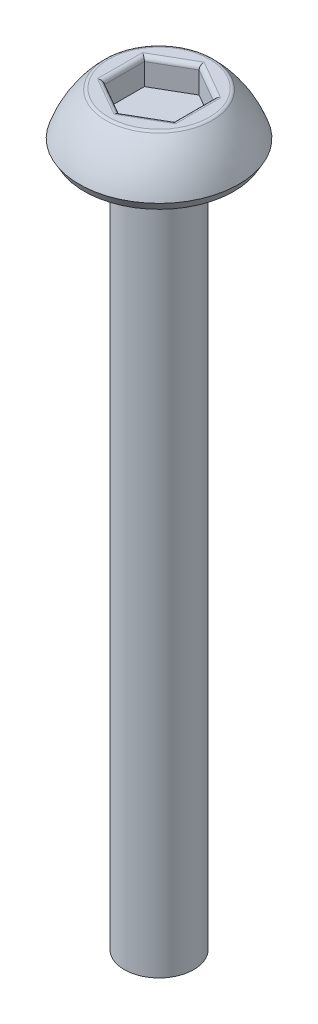
ISO-10303-21;
HEADER;
FILE_DESCRIPTION(('STEP AP214'),'2;1');
FILE_NAME('part.step','',(''),(''),'','','');
FILE_SCHEMA(('AUTOMOTIVE_DESIGN { 1 0 10303 214 1 1 1 1 }'));
ENDSEC;
DATA;
#1=APPLICATION_CONTEXT('core data for automotive mechanical design processes');
#2=APPLICATION_PROTOCOL_DEFINITION('international standard','automotive_design',2000,#1);
#3=PRODUCT_CONTEXT('',#1,'mechanical');
#4=PRODUCT('Part','Part','',(#3));
#5=PRODUCT_RELATED_PRODUCT_CATEGORY('part','',(#4));
#6=PRODUCT_DEFINITION_FORMATION('','',#4);
#7=PRODUCT_DEFINITION_CONTEXT('part definition',#1,'design');
#8=PRODUCT_DEFINITION('design','',#6,#7);
#9=PRODUCT_DEFINITION_SHAPE('','',#8);
#10=(LENGTH_UNIT() NAMED_UNIT(*) SI_UNIT(.MILLI.,.METRE.));
#11=(NAMED_UNIT(*) PLANE_ANGLE_UNIT() SI_UNIT($,.RADIAN.));
#12=(NAMED_UNIT(*) SI_UNIT($,.STERADIAN.) SOLID_ANGLE_UNIT());
#13=UNCERTAINTY_MEASURE_WITH_UNIT(LENGTH_MEASURE(1.E-05),#10,'distance_accuracy_value','');
#14=(GEOMETRIC_REPRESENTATION_CONTEXT(3) GLOBAL_UNCERTAINTY_ASSIGNED_CONTEXT((#13)) GLOBAL_UNIT_ASSIGNED_CONTEXT((#10,
#11,#12)) REPRESENTATION_CONTEXT('',''));
#15=CARTESIAN_POINT('',(0.,0.,0.));
#16=DIRECTION('',(0.,0.,1.));
#17=DIRECTION('',(1.,0.,0.));
#18=AXIS2_PLACEMENT_3D('',#15,#16,#17);
#19=CARTESIAN_POINT('',(0.,1.5,0.));
#20=DIRECTION('',(0.,-1.,0.));
#21=DIRECTION('',(0.,0.,-1.));
#22=AXIS2_PLACEMENT_3D('',#19,#20,#21);
#23=PLANE('',#22);
#24=CARTESIAN_POINT('',(0.,1.5,0.));
#25=DIRECTION('',(0.,-1.,0.));
#26=DIRECTION('',(0.,0.,-1.));
#27=AXIS2_PLACEMENT_3D('',#24,#25,#26);
#28=CIRCLE('',#27,1.45007695941143);
#29=CARTESIAN_POINT('',(0.,1.5,-1.45007695941143));
#30=VERTEX_POINT('',#29);
#31=EDGE_CURVE('E178',#30,#30,#28,.F.);
#32=ORIENTED_EDGE('',*,*,#31,.T.);
#33=EDGE_LOOP('',(#32));
#34=FACE_BOUND('',#33,.T.);
#35=DIRECTION('',(0.866025403784439,0.,-0.5));
#36=VECTOR('',#35,1.);
#37=CARTESIAN_POINT('',(0.5625,1.5,0.974278579257493));
#38=LINE('',#37,#36);
#39=CARTESIAN_POINT('',(1.125,1.5,0.649519052838329));
#40=VERTEX_POINT('',#39);
#41=CARTESIAN_POINT('',(0.,1.5,1.29903810567666));
#42=VERTEX_POINT('',#41);
#43=EDGE_CURVE('E173',#40,#42,#38,.F.);
#44=ORIENTED_EDGE('',*,*,#43,.T.);
#45=DIRECTION('',(0.866025403784439,0.,0.5));
#46=VECTOR('',#45,1.);
#47=CARTESIAN_POINT('',(-0.5625,1.5,0.974278579257493));
#48=LINE('',#47,#46);
#49=CARTESIAN_POINT('',(-1.125,1.5,0.649519052838329));
#50=VERTEX_POINT('',#49);
#51=EDGE_CURVE('E175',#42,#50,#48,.F.);
#52=ORIENTED_EDGE('',*,*,#51,.T.);
#53=DIRECTION('',(0.,0.,1.));
#54=VECTOR('',#53,1.);
#55=CARTESIAN_POINT('',(-1.125,1.5,0.));
#56=LINE('',#55,#54);
#57=CARTESIAN_POINT('',(-1.125,1.5,-0.649519052838329));
#58=VERTEX_POINT('',#57);
#59=EDGE_CURVE('E165',#50,#58,#56,.F.);
#60=ORIENTED_EDGE('',*,*,#59,.T.);
#61=DIRECTION('',(-0.866025403784439,0.,0.5));
#62=VECTOR('',#61,1.);
#63=CARTESIAN_POINT('',(-0.5625,1.5,-0.974278579257493));
#64=LINE('',#63,#62);
#65=CARTESIAN_POINT('',(0.,1.5,-1.29903810567666));
#66=VERTEX_POINT('',#65);
#67=EDGE_CURVE('E167',#58,#66,#64,.F.);
#68=ORIENTED_EDGE('',*,*,#67,.T.);
#69=DIRECTION('',(-0.866025403784439,0.,-0.5));
#70=VECTOR('',#69,1.);
#71=CARTESIAN_POINT('',(0.5625,1.5,-0.974278579257494));
#72=LINE('',#71,#70);
#73=CARTESIAN_POINT('',(1.125,1.5,-0.64951905283833));
#74=VERTEX_POINT('',#73);
#75=EDGE_CURVE('E169',#66,#74,#72,.F.);
#76=ORIENTED_EDGE('',*,*,#75,.T.);
#77=DIRECTION('',(0.,0.,-1.));
#78=VECTOR('',#77,1.);
#79=CARTESIAN_POINT('',(1.125,1.5,0.));
#80=LINE('',#79,#78);
#81=EDGE_CURVE('E171',#74,#40,#80,.F.);
#82=ORIENTED_EDGE('',*,*,#81,.T.);
#83=EDGE_LOOP('',(#44,#52,#60,#68,#76,#82));
#84=FACE_BOUND('',#83,.T.);
#85=ADVANCED_FACE('F36',(#34,#84),#23,.F.);
#86=CARTESIAN_POINT('',(0.,-0.691910970237067,0.));
#87=DIRECTION('',(0.,-1.,0.));
#88=DIRECTION('',(0.,0.,-1.));
#89=AXIS2_PLACEMENT_3D('',#86,#87,#88);
#90=DEGENERATE_TOROIDAL_SURFACE('',#89,0.548298390995416,3.,.F.);
#91=CARTESIAN_POINT('',(0.,1.46486569435813,0.));
#92=DIRECTION('',(0.,-1.,0.));
#93=DIRECTION('',(0.,0.,-1.));
#94=AXIS2_PLACEMENT_3D('',#91,#92,#93);
#95=CIRCLE('',#94,1.53696284421173);
#96=CARTESIAN_POINT('',(0.,1.46486569435813,-1.53696284421173));
#97=VERTEX_POINT('',#96);
#98=EDGE_CURVE('E162',#97,#97,#95,.T.);
#99=ORIENTED_EDGE('',*,*,#98,.T.);
#100=EDGE_LOOP('',(#99));
#101=FACE_BOUND('',#100,.T.);
#102=CARTESIAN_POINT('',(0.,0.25,0.));
#103=DIRECTION('',(0.,-1.,0.));
#104=DIRECTION('',(0.,0.,-1.));
#105=AXIS2_PLACEMENT_3D('',#102,#103,#104);
#106=CIRCLE('',#105,2.3);
#107=CARTESIAN_POINT('',(0.,0.25,-2.3));
#108=VERTEX_POINT('',#107);
#109=EDGE_CURVE('E159',#108,#108,#106,.T.);
#110=ORIENTED_EDGE('',*,*,#109,.F.);
#111=EDGE_LOOP('',(#110));
#112=FACE_BOUND('',#111,.T.);
#113=ADVANCED_FACE('F245',(#101,#112),#90,.F.);
#114=CARTESIAN_POINT('',(0.,0.25,0.));
#115=DIRECTION('',(0.,1.,0.));
#116=DIRECTION('',(0.,0.,1.));
#117=AXIS2_PLACEMENT_3D('',#114,#115,#116);
#118=CONICAL_SURFACE('',#117,2.3,0.523598775598296);
#119=CARTESIAN_POINT('',(0.,0.,0.));
#120=DIRECTION('',(0.,-1.,0.));
#121=DIRECTION('',(0.,0.,-1.));
#122=AXIS2_PLACEMENT_3D('',#119,#120,#121);
#123=CIRCLE('',#122,2.15566243270259);
#124=CARTESIAN_POINT('',(0.,0.,-2.15566243270259));
#125=VERTEX_POINT('',#124);
#126=EDGE_CURVE('E156',#125,#125,#123,.T.);
#127=ORIENTED_EDGE('',*,*,#126,.F.);
#128=EDGE_LOOP('',(#127));
#129=FACE_BOUND('',#128,.T.);
#130=ORIENTED_EDGE('',*,*,#109,.T.);
#131=EDGE_LOOP('',(#130));
#132=FACE_BOUND('',#131,.T.);
#133=ADVANCED_FACE('F251',(#129,#132),#118,.T.);
#134=CARTESIAN_POINT('',(0.,0.,2.15566243270259));
#135=DIRECTION('',(0.,1.,0.));
#136=DIRECTION('',(0.,0.,1.));
#137=AXIS2_PLACEMENT_3D('',#134,#135,#136);
#138=PLANE('',#137);
#139=CARTESIAN_POINT('',(0.,0.,0.));
#140=DIRECTION('',(0.,-1.,0.));
#141=DIRECTION('',(0.,0.,-1.));
#142=AXIS2_PLACEMENT_3D('',#139,#140,#141);
#143=CIRCLE('',#142,1.);
#144=CARTESIAN_POINT('',(0.,0.,-1.));
#145=VERTEX_POINT('',#144);
#146=EDGE_CURVE('E153',#145,#145,#143,.T.);
#147=ORIENTED_EDGE('',*,*,#146,.F.);
#148=EDGE_LOOP('',(#147));
#149=FACE_BOUND('',#148,.T.);
#150=ORIENTED_EDGE('',*,*,#126,.T.);
#151=EDGE_LOOP('',(#150));
#152=FACE_BOUND('',#151,.T.);
#153=ADVANCED_FACE('F270',(#149,#152),#138,.F.);
#154=CARTESIAN_POINT('',(0.,-20.,0.));
#155=DIRECTION('',(0.,-1.,0.));
#156=DIRECTION('',(0.,0.,-1.));
#157=AXIS2_PLACEMENT_3D('',#154,#155,#156);
#158=CYLINDRICAL_SURFACE('',#157,0.999999999999999);
#159=CARTESIAN_POINT('',(0.,-20.,0.));
#160=DIRECTION('',(0.,-1.,0.));
#161=DIRECTION('',(0.,0.,-1.));
#162=AXIS2_PLACEMENT_3D('',#159,#160,#161);
#163=CIRCLE('',#162,0.999999999999998);
#164=CARTESIAN_POINT('',(0.,-20.,-0.999999999999998));
#165=VERTEX_POINT('',#164);
#166=EDGE_CURVE('E140',#165,#165,#163,.T.);
#167=ORIENTED_EDGE('',*,*,#166,.F.);
#168=EDGE_LOOP('',(#167));
#169=FACE_BOUND('',#168,.T.);
#170=ORIENTED_EDGE('',*,*,#146,.T.);
#171=EDGE_LOOP('',(#170));
#172=FACE_BOUND('',#171,.T.);
#173=ADVANCED_FACE('F275',(#169,#172),#158,.T.);
#174=CARTESIAN_POINT('',(0.,-20.,0.999999999999998));
#175=DIRECTION('',(0.,1.,0.));
#176=DIRECTION('',(0.,0.,1.));
#177=AXIS2_PLACEMENT_3D('',#174,#175,#176);
#178=PLANE('',#177);
#179=ORIENTED_EDGE('',*,*,#166,.T.);
#180=EDGE_LOOP('',(#179));
#181=FACE_BOUND('',#180,.T.);
#182=ADVANCED_FACE('F282',(#181),#178,.F.);
#183=CARTESIAN_POINT('',(0.999999999999999,0.75,-0.577350269189626));
#184=DIRECTION('',(0.5,0.,-0.866025403784439));
#185=DIRECTION('',(-0.866025403784439,0.,-0.5));
#186=AXIS2_PLACEMENT_3D('',#183,#184,#185);
#187=PLANE('',#186);
#188=DIRECTION('',(0.,1.,0.));
#189=VECTOR('',#188,1.);
#190=CARTESIAN_POINT('',(0.999999999999999,0.75,-0.577350269189626));
#191=LINE('',#190,#189);
#192=CARTESIAN_POINT('',(0.999999999999999,0.75,-0.577350269189626));
#193=VERTEX_POINT('',#192);
#194=CARTESIAN_POINT('',(0.999999999999999,1.375,-0.577350269189626));
#195=VERTEX_POINT('',#194);
#196=EDGE_CURVE('E138',#193,#195,#191,.T.);
#197=ORIENTED_EDGE('',*,*,#196,.T.);
#198=DIRECTION('',(-0.866025403784439,0.,-0.5));
#199=VECTOR('',#198,1.);
#200=CARTESIAN_POINT('',(0.999999999999999,1.375,-0.577350269189626));
#201=LINE('',#200,#199);
#202=CARTESIAN_POINT('',(0.,1.375,-1.15470053837925));
#203=VERTEX_POINT('',#202);
#204=EDGE_CURVE('E60',#195,#203,#201,.T.);
#205=ORIENTED_EDGE('',*,*,#204,.T.);
#206=DIRECTION('',(0.,1.,0.));
#207=VECTOR('',#206,1.);
#208=CARTESIAN_POINT('',(0.,0.75,-1.15470053837925));
#209=LINE('',#208,#207);
#210=CARTESIAN_POINT('',(0.,0.75,-1.15470053837925));
#211=VERTEX_POINT('',#210);
#212=EDGE_CURVE('E106',#211,#203,#209,.T.);
#213=ORIENTED_EDGE('',*,*,#212,.F.);
#214=DIRECTION('',(-0.866025403784439,0.,-0.5));
#215=VECTOR('',#214,1.);
#216=CARTESIAN_POINT('',(0.999999999999999,0.75,-0.577350269189626));
#217=LINE('',#216,#215);
#218=EDGE_CURVE('E110',#193,#211,#217,.T.);
#219=ORIENTED_EDGE('',*,*,#218,.F.);
#220=EDGE_LOOP('',(#197,#205,#213,#219));
#221=FACE_BOUND('',#220,.T.);
#222=ADVANCED_FACE('F108',(#221),#187,.F.);
#223=CARTESIAN_POINT('',(1.,0.75,0.577350269189626));
#224=DIRECTION('',(1.,0.,0.));
#225=DIRECTION('',(0.,0.,-1.));
#226=AXIS2_PLACEMENT_3D('',#223,#224,#225);
#227=PLANE('',#226);
#228=DIRECTION('',(0.,1.,0.));
#229=VECTOR('',#228,1.);
#230=CARTESIAN_POINT('',(1.,0.75,0.577350269189626));
#231=LINE('',#230,#229);
#232=CARTESIAN_POINT('',(1.,0.75,0.577350269189626));
#233=VERTEX_POINT('',#232);
#234=CARTESIAN_POINT('',(1.,1.375,0.577350269189626));
#235=VERTEX_POINT('',#234);
#236=EDGE_CURVE('E141',#233,#235,#231,.T.);
#237=ORIENTED_EDGE('',*,*,#236,.T.);
#238=DIRECTION('',(0.,0.,-1.));
#239=VECTOR('',#238,1.);
#240=CARTESIAN_POINT('',(1.,1.375,0.577350269189626));
#241=LINE('',#240,#239);
#242=EDGE_CURVE('E186',#235,#195,#241,.T.);
#243=ORIENTED_EDGE('',*,*,#242,.T.);
#244=ORIENTED_EDGE('',*,*,#196,.F.);
#245=DIRECTION('',(0.,0.,-1.));
#246=VECTOR('',#245,1.);
#247=CARTESIAN_POINT('',(1.,0.75,0.577350269189626));
#248=LINE('',#247,#246);
#249=EDGE_CURVE('E114',#233,#193,#248,.T.);
#250=ORIENTED_EDGE('',*,*,#249,.F.);
#251=EDGE_LOOP('',(#237,#243,#244,#250));
#252=FACE_BOUND('',#251,.T.);
#253=ADVANCED_FACE('F226',(#252),#227,.F.);
#254=CARTESIAN_POINT('',(0.,0.75,1.15470053837925));
#255=DIRECTION('',(0.5,0.,0.866025403784439));
#256=DIRECTION('',(0.866025403784439,0.,-0.5));
#257=AXIS2_PLACEMENT_3D('',#254,#255,#256);
#258=PLANE('',#257);
#259=DIRECTION('',(0.,1.,0.));
#260=VECTOR('',#259,1.);
#261=CARTESIAN_POINT('',(0.,0.75,1.15470053837925));
#262=LINE('',#261,#260);
#263=CARTESIAN_POINT('',(0.,0.75,1.15470053837925));
#264=VERTEX_POINT('',#263);
#265=CARTESIAN_POINT('',(0.,1.375,1.15470053837925));
#266=VERTEX_POINT('',#265);
#267=EDGE_CURVE('E144',#264,#266,#262,.T.);
#268=ORIENTED_EDGE('',*,*,#267,.T.);
#269=DIRECTION('',(0.866025403784439,0.,-0.5));
#270=VECTOR('',#269,1.);
#271=CARTESIAN_POINT('',(0.,1.375,1.15470053837925));
#272=LINE('',#271,#270);
#273=EDGE_CURVE('E184',#266,#235,#272,.T.);
#274=ORIENTED_EDGE('',*,*,#273,.T.);
#275=ORIENTED_EDGE('',*,*,#236,.F.);
#276=DIRECTION('',(0.866025403784439,0.,-0.5));
#277=VECTOR('',#276,1.);
#278=CARTESIAN_POINT('',(0.,0.75,1.15470053837925));
#279=LINE('',#278,#277);
#280=EDGE_CURVE('E135',#264,#233,#279,.T.);
#281=ORIENTED_EDGE('',*,*,#280,.F.);
#282=EDGE_LOOP('',(#268,#274,#275,#281));
#283=FACE_BOUND('',#282,.T.);
#284=ADVANCED_FACE('F227',(#283),#258,.F.);
#285=CARTESIAN_POINT('',(-0.999999999999999,0.75,0.577350269189626));
#286=DIRECTION('',(-0.5,0.,0.866025403784439));
#287=DIRECTION('',(0.866025403784439,0.,0.5));
#288=AXIS2_PLACEMENT_3D('',#285,#286,#287);
#289=PLANE('',#288);
#290=DIRECTION('',(0.,1.,0.));
#291=VECTOR('',#290,1.);
#292=CARTESIAN_POINT('',(-0.999999999999999,0.75,0.577350269189626));
#293=LINE('',#292,#291);
#294=CARTESIAN_POINT('',(-0.999999999999999,0.75,0.577350269189626));
#295=VERTEX_POINT('',#294);
#296=CARTESIAN_POINT('',(-0.999999999999999,1.375,0.577350269189626));
#297=VERTEX_POINT('',#296);
#298=EDGE_CURVE('E147',#295,#297,#293,.T.);
#299=ORIENTED_EDGE('',*,*,#298,.T.);
#300=DIRECTION('',(0.866025403784439,0.,0.5));
#301=VECTOR('',#300,1.);
#302=CARTESIAN_POINT('',(-0.999999999999999,1.375,0.577350269189626));
#303=LINE('',#302,#301);
#304=EDGE_CURVE('E181',#297,#266,#303,.T.);
#305=ORIENTED_EDGE('',*,*,#304,.T.);
#306=ORIENTED_EDGE('',*,*,#267,.F.);
#307=DIRECTION('',(0.866025403784439,0.,0.5));
#308=VECTOR('',#307,1.);
#309=CARTESIAN_POINT('',(-0.999999999999999,0.75,0.577350269189626));
#310=LINE('',#309,#308);
#311=EDGE_CURVE('E132',#295,#264,#310,.T.);
#312=ORIENTED_EDGE('',*,*,#311,.F.);
#313=EDGE_LOOP('',(#299,#305,#306,#312));
#314=FACE_BOUND('',#313,.T.);
#315=ADVANCED_FACE('F222',(#314),#289,.F.);
#316=CARTESIAN_POINT('',(-1.,0.75,-0.577350269189626));
#317=DIRECTION('',(-1.,0.,0.));
#318=DIRECTION('',(0.,0.,1.));
#319=AXIS2_PLACEMENT_3D('',#316,#317,#318);
#320=PLANE('',#319);
#321=DIRECTION('',(0.,1.,0.));
#322=VECTOR('',#321,1.);
#323=CARTESIAN_POINT('',(-1.,0.75,-0.577350269189626));
#324=LINE('',#323,#322);
#325=CARTESIAN_POINT('',(-1.,0.75,-0.577350269189626));
#326=VERTEX_POINT('',#325);
#327=CARTESIAN_POINT('',(-1.,1.375,-0.577350269189626));
#328=VERTEX_POINT('',#327);
#329=EDGE_CURVE('E113',#326,#328,#324,.T.);
#330=ORIENTED_EDGE('',*,*,#329,.T.);
#331=DIRECTION('',(0.,0.,1.));
#332=VECTOR('',#331,1.);
#333=CARTESIAN_POINT('',(-1.,1.375,-0.577350269189626));
#334=LINE('',#333,#332);
#335=EDGE_CURVE('E11',#328,#297,#334,.T.);
#336=ORIENTED_EDGE('',*,*,#335,.T.);
#337=ORIENTED_EDGE('',*,*,#298,.F.);
#338=DIRECTION('',(0.,0.,1.));
#339=VECTOR('',#338,1.);
#340=CARTESIAN_POINT('',(-1.,0.75,-0.577350269189626));
#341=LINE('',#340,#339);
#342=EDGE_CURVE('E122',#326,#295,#341,.T.);
#343=ORIENTED_EDGE('',*,*,#342,.F.);
#344=EDGE_LOOP('',(#330,#336,#337,#343));
#345=FACE_BOUND('',#344,.T.);
#346=ADVANCED_FACE('F219',(#345),#320,.F.);
#347=CARTESIAN_POINT('',(0.,0.75,-1.15470053837925));
#348=DIRECTION('',(-0.5,0.,-0.866025403784438));
#349=DIRECTION('',(-0.866025403784439,0.,0.5));
#350=AXIS2_PLACEMENT_3D('',#347,#348,#349);
#351=PLANE('',#350);
#352=ORIENTED_EDGE('',*,*,#212,.T.);
#353=DIRECTION('',(-0.866025403784439,0.,0.5));
#354=VECTOR('',#353,1.);
#355=CARTESIAN_POINT('',(0.,1.375,-1.15470053837925));
#356=LINE('',#355,#354);
#357=EDGE_CURVE('E45',#203,#328,#356,.T.);
#358=ORIENTED_EDGE('',*,*,#357,.T.);
#359=ORIENTED_EDGE('',*,*,#329,.F.);
#360=DIRECTION('',(-0.866025403784439,0.,0.5));
#361=VECTOR('',#360,1.);
#362=CARTESIAN_POINT('',(0.,0.75,-1.15470053837925));
#363=LINE('',#362,#361);
#364=EDGE_CURVE('E117',#211,#326,#363,.T.);
#365=ORIENTED_EDGE('',*,*,#364,.F.);
#366=EDGE_LOOP('',(#352,#358,#359,#365));
#367=FACE_BOUND('',#366,.T.);
#368=ADVANCED_FACE('F118',(#367),#351,.F.);
#369=CARTESIAN_POINT('',(0.,0.75,0.));
#370=DIRECTION('',(0.,1.,0.));
#371=DIRECTION('',(0.,0.,1.));
#372=AXIS2_PLACEMENT_3D('',#369,#370,#371);
#373=PLANE('',#372);
#374=ORIENTED_EDGE('',*,*,#218,.T.);
#375=ORIENTED_EDGE('',*,*,#364,.T.);
#376=ORIENTED_EDGE('',*,*,#342,.T.);
#377=ORIENTED_EDGE('',*,*,#311,.T.);
#378=ORIENTED_EDGE('',*,*,#280,.T.);
#379=ORIENTED_EDGE('',*,*,#249,.T.);
#380=EDGE_LOOP('',(#374,#375,#376,#377,#378,#379));
#381=FACE_BOUND('',#380,.T.);
#382=ADVANCED_FACE('F124',(#381),#373,.T.);
#383=CARTESIAN_POINT('',(0.,1.375,0.));
#384=DIRECTION('',(0.,-1.,0.));
#385=DIRECTION('',(0.,0.,-1.));
#386=AXIS2_PLACEMENT_3D('',#383,#384,#385);
#387=TOROIDAL_SURFACE('',#386,1.45007695941143,0.125);
#388=ORIENTED_EDGE('',*,*,#31,.F.);
#389=EDGE_LOOP('',(#388));
#390=FACE_BOUND('',#389,.T.);
#391=ORIENTED_EDGE('',*,*,#98,.F.);
#392=EDGE_LOOP('',(#391));
#393=FACE_BOUND('',#392,.T.);
#394=ADVANCED_FACE('F255',(#390,#393),#387,.T.);
#395=CARTESIAN_POINT('',(1.0625,1.375,-0.685603444662681));
#396=DIRECTION('',(-0.866025403784439,0.,-0.5));
#397=DIRECTION('',(-0.5,0.,0.866025403784439));
#398=AXIS2_PLACEMENT_3D('',#395,#396,#397);
#399=CYLINDRICAL_SURFACE('',#398,0.125);
#400=CARTESIAN_POINT('',(1.125,1.375,-0.64951905283833));
#401=DIRECTION('',(-0.5,0.,-0.866025403784438));
#402=DIRECTION('',(0.866025403784439,0.,-0.5));
#403=AXIS2_PLACEMENT_3D('',#400,#401,#402);
#404=ELLIPSE('',#403,0.144337567297406,0.125);
#405=EDGE_CURVE('E129',#74,#195,#404,.F.);
#406=ORIENTED_EDGE('',*,*,#405,.F.);
#407=ORIENTED_EDGE('',*,*,#75,.F.);
#408=CARTESIAN_POINT('',(0.,1.375,-1.29903810567666));
#409=DIRECTION('',(-1.,0.,0.));
#410=DIRECTION('',(0.,0.,-1.));
#411=AXIS2_PLACEMENT_3D('',#408,#409,#410);
#412=ELLIPSE('',#411,0.144337567297406,0.125);
#413=EDGE_CURVE('E40',#203,#66,#412,.T.);
#414=ORIENTED_EDGE('',*,*,#413,.F.);
#415=ORIENTED_EDGE('',*,*,#204,.F.);
#416=EDGE_LOOP('',(#406,#407,#414,#415));
#417=FACE_BOUND('',#416,.T.);
#418=ADVANCED_FACE('F38',(#417),#399,.T.);
#419=CARTESIAN_POINT('',(-0.0625000000000002,1.375,-1.26295371385231));
#420=DIRECTION('',(-0.866025403784439,0.,0.5));
#421=DIRECTION('',(0.5,0.,0.866025403784439));
#422=AXIS2_PLACEMENT_3D('',#419,#420,#421);
#423=CYLINDRICAL_SURFACE('',#422,0.125);
#424=ORIENTED_EDGE('',*,*,#413,.T.);
#425=ORIENTED_EDGE('',*,*,#67,.F.);
#426=CARTESIAN_POINT('',(-1.125,1.375,-0.649519052838329));
#427=DIRECTION('',(-0.5,0.,0.866025403784439));
#428=DIRECTION('',(-0.866025403784439,0.,-0.5));
#429=AXIS2_PLACEMENT_3D('',#426,#427,#428);
#430=ELLIPSE('',#429,0.144337567297406,0.125);
#431=EDGE_CURVE('E197',#328,#58,#430,.T.);
#432=ORIENTED_EDGE('',*,*,#431,.F.);
#433=ORIENTED_EDGE('',*,*,#357,.F.);
#434=EDGE_LOOP('',(#424,#425,#432,#433));
#435=FACE_BOUND('',#434,.T.);
#436=ADVANCED_FACE('F211',(#435),#423,.T.);
#437=CARTESIAN_POINT('',(1.125,1.375,0.577350269189626));
#438=DIRECTION('',(0.,0.,-1.));
#439=DIRECTION('',(-1.,0.,0.));
#440=AXIS2_PLACEMENT_3D('',#437,#438,#439);
#441=CYLINDRICAL_SURFACE('',#440,0.125);
#442=ORIENTED_EDGE('',*,*,#405,.T.);
#443=ORIENTED_EDGE('',*,*,#242,.F.);
#444=CARTESIAN_POINT('',(1.125,1.375,0.649519052838329));
#445=DIRECTION('',(0.5,0.,-0.866025403784439));
#446=DIRECTION('',(0.866025403784439,0.,0.5));
#447=AXIS2_PLACEMENT_3D('',#444,#445,#446);
#448=ELLIPSE('',#447,0.144337567297406,0.125);
#449=EDGE_CURVE('E194',#40,#235,#448,.F.);
#450=ORIENTED_EDGE('',*,*,#449,.F.);
#451=ORIENTED_EDGE('',*,*,#81,.F.);
#452=EDGE_LOOP('',(#442,#443,#450,#451));
#453=FACE_BOUND('',#452,.T.);
#454=ADVANCED_FACE('F204',(#453),#441,.T.);
#455=CARTESIAN_POINT('',(-1.125,1.375,-0.577350269189626));
#456=DIRECTION('',(0.,0.,1.));
#457=DIRECTION('',(1.,0.,0.));
#458=AXIS2_PLACEMENT_3D('',#455,#456,#457);
#459=CYLINDRICAL_SURFACE('',#458,0.125);
#460=ORIENTED_EDGE('',*,*,#431,.T.);
#461=ORIENTED_EDGE('',*,*,#59,.F.);
#462=CARTESIAN_POINT('',(-1.125,1.375,0.649519052838329));
#463=DIRECTION('',(0.5,0.,0.866025403784438));
#464=DIRECTION('',(0.866025403784439,0.,-0.5));
#465=AXIS2_PLACEMENT_3D('',#462,#463,#464);
#466=ELLIPSE('',#465,0.144337567297406,0.125);
#467=EDGE_CURVE('E192',#297,#50,#466,.T.);
#468=ORIENTED_EDGE('',*,*,#467,.F.);
#469=ORIENTED_EDGE('',*,*,#335,.F.);
#470=EDGE_LOOP('',(#460,#461,#468,#469));
#471=FACE_BOUND('',#470,.T.);
#472=ADVANCED_FACE('F216',(#471),#459,.T.);
#473=CARTESIAN_POINT('',(0.0625000000000004,1.375,1.26295371385231));
#474=DIRECTION('',(0.866025403784439,0.,-0.5));
#475=DIRECTION('',(-0.5,0.,-0.866025403784439));
#476=AXIS2_PLACEMENT_3D('',#473,#474,#475);
#477=CYLINDRICAL_SURFACE('',#476,0.125);
#478=ORIENTED_EDGE('',*,*,#449,.T.);
#479=ORIENTED_EDGE('',*,*,#273,.F.);
#480=CARTESIAN_POINT('',(0.,1.375,1.29903810567666));
#481=DIRECTION('',(1.,0.,0.));
#482=DIRECTION('',(0.,0.,1.));
#483=AXIS2_PLACEMENT_3D('',#480,#481,#482);
#484=ELLIPSE('',#483,0.144337567297406,0.125);
#485=EDGE_CURVE('E190',#42,#266,#484,.F.);
#486=ORIENTED_EDGE('',*,*,#485,.F.);
#487=ORIENTED_EDGE('',*,*,#43,.F.);
#488=EDGE_LOOP('',(#478,#479,#486,#487));
#489=FACE_BOUND('',#488,.T.);
#490=ADVANCED_FACE('F231',(#489),#477,.T.);
#491=CARTESIAN_POINT('',(-1.0625,1.375,0.685603444662681));
#492=DIRECTION('',(0.866025403784439,0.,0.5));
#493=DIRECTION('',(0.5,0.,-0.866025403784439));
#494=AXIS2_PLACEMENT_3D('',#491,#492,#493);
#495=CYLINDRICAL_SURFACE('',#494,0.125);
#496=ORIENTED_EDGE('',*,*,#467,.T.);
#497=ORIENTED_EDGE('',*,*,#51,.F.);
#498=ORIENTED_EDGE('',*,*,#485,.T.);
#499=ORIENTED_EDGE('',*,*,#304,.F.);
#500=EDGE_LOOP('',(#496,#497,#498,#499));
#501=FACE_BOUND('',#500,.T.);
#502=ADVANCED_FACE('F236',(#501),#495,.T.);
#503=CLOSED_SHELL('',(#85,#113,#133,#153,#173,#182,#222,#253,#284,#315,#346,#368,#382,#394,#418,
#436,#454,#472,#490,#502));
#504=MANIFOLD_SOLID_BREP('B2',#503);
#505=ADVANCED_BREP_SHAPE_REPRESENTATION('',(#18,#504),#14);
#506=SHAPE_DEFINITION_REPRESENTATION(#9,#505);
ENDSEC;
END-ISO-10303-21;
